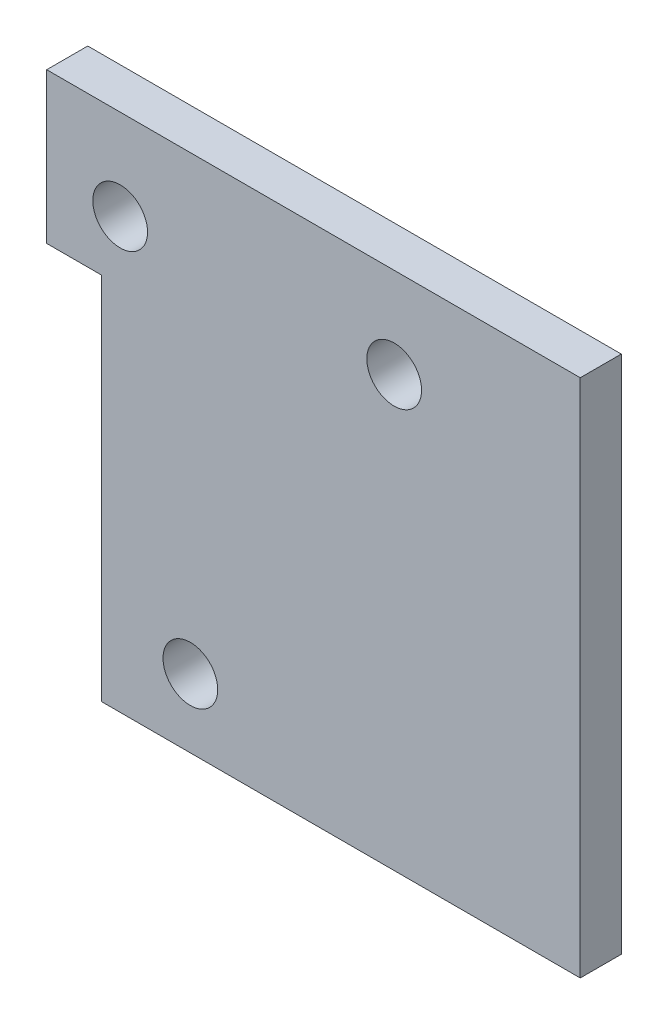
ISO-10303-21;
HEADER;
FILE_DESCRIPTION(('STEP AP214'),'2;1');
FILE_NAME('part.step','',(''),(''),'','','');
FILE_SCHEMA(('AUTOMOTIVE_DESIGN { 1 0 10303 214 1 1 1 1 }'));
ENDSEC;
DATA;
#1=APPLICATION_CONTEXT('core data for automotive mechanical design processes');
#2=APPLICATION_PROTOCOL_DEFINITION('international standard','automotive_design',2000,#1);
#3=PRODUCT_CONTEXT('',#1,'mechanical');
#4=PRODUCT('Part','Part','',(#3));
#5=PRODUCT_RELATED_PRODUCT_CATEGORY('part','',(#4));
#6=PRODUCT_DEFINITION_FORMATION('','',#4);
#7=PRODUCT_DEFINITION_CONTEXT('part definition',#1,'design');
#8=PRODUCT_DEFINITION('design','',#6,#7);
#9=PRODUCT_DEFINITION_SHAPE('','',#8);
#10=(LENGTH_UNIT() NAMED_UNIT(*) SI_UNIT(.MILLI.,.METRE.));
#11=(NAMED_UNIT(*) PLANE_ANGLE_UNIT() SI_UNIT($,.RADIAN.));
#12=(NAMED_UNIT(*) SI_UNIT($,.STERADIAN.) SOLID_ANGLE_UNIT());
#13=UNCERTAINTY_MEASURE_WITH_UNIT(LENGTH_MEASURE(1.E-05),#10,'distance_accuracy_value','');
#14=(GEOMETRIC_REPRESENTATION_CONTEXT(3) GLOBAL_UNCERTAINTY_ASSIGNED_CONTEXT((#13)) GLOBAL_UNIT_ASSIGNED_CONTEXT((#10,
#11,#12)) REPRESENTATION_CONTEXT('',''));
#15=CARTESIAN_POINT('',(0.,0.,0.));
#16=DIRECTION('',(0.,0.,1.));
#17=DIRECTION('',(1.,0.,0.));
#18=AXIS2_PLACEMENT_3D('',#15,#16,#17);
#19=CARTESIAN_POINT('',(39.,0.,3.));
#20=DIRECTION('',(-1.,0.,0.));
#21=DIRECTION('',(0.,0.,1.));
#22=AXIS2_PLACEMENT_3D('',#19,#20,#21);
#23=PLANE('',#22);
#24=DIRECTION('',(0.,1.,0.));
#25=VECTOR('',#24,1.);
#26=CARTESIAN_POINT('',(39.,0.,0.));
#27=LINE('',#26,#25);
#28=CARTESIAN_POINT('',(39.,0.,0.));
#29=VERTEX_POINT('',#28);
#30=CARTESIAN_POINT('',(39.,38.,0.));
#31=VERTEX_POINT('',#30);
#32=EDGE_CURVE('E118',#29,#31,#27,.T.);
#33=ORIENTED_EDGE('',*,*,#32,.T.);
#34=DIRECTION('',(0.,0.,-1.));
#35=VECTOR('',#34,1.);
#36=CARTESIAN_POINT('',(39.,38.,3.));
#37=LINE('',#36,#35);
#38=CARTESIAN_POINT('',(39.,38.,3.));
#39=VERTEX_POINT('',#38);
#40=EDGE_CURVE('E136',#39,#31,#37,.T.);
#41=ORIENTED_EDGE('',*,*,#40,.F.);
#42=DIRECTION('',(0.,1.,0.));
#43=VECTOR('',#42,1.);
#44=CARTESIAN_POINT('',(39.,0.,3.));
#45=LINE('',#44,#43);
#46=CARTESIAN_POINT('',(39.,0.,3.));
#47=VERTEX_POINT('',#46);
#48=EDGE_CURVE('E129',#47,#39,#45,.T.);
#49=ORIENTED_EDGE('',*,*,#48,.F.);
#50=DIRECTION('',(0.,0.,-1.));
#51=VECTOR('',#50,1.);
#52=CARTESIAN_POINT('',(39.,0.,3.));
#53=LINE('',#52,#51);
#54=EDGE_CURVE('E114',#47,#29,#53,.T.);
#55=ORIENTED_EDGE('',*,*,#54,.T.);
#56=EDGE_LOOP('',(#33,#41,#49,#55));
#57=FACE_BOUND('',#56,.T.);
#58=ADVANCED_FACE('F32',(#57),#23,.F.);
#59=CARTESIAN_POINT('',(0.,38.,3.));
#60=DIRECTION('',(0.,-1.,0.));
#61=DIRECTION('',(0.,0.,-1.));
#62=AXIS2_PLACEMENT_3D('',#59,#60,#61);
#63=PLANE('',#62);
#64=DIRECTION('',(-1.,0.,0.));
#65=VECTOR('',#64,1.);
#66=CARTESIAN_POINT('',(0.,38.,0.));
#67=LINE('',#66,#65);
#68=CARTESIAN_POINT('',(0.,38.,0.));
#69=VERTEX_POINT('',#68);
#70=EDGE_CURVE('E121',#31,#69,#67,.T.);
#71=ORIENTED_EDGE('',*,*,#70,.T.);
#72=DIRECTION('',(0.,0.,-1.));
#73=VECTOR('',#72,1.);
#74=CARTESIAN_POINT('',(0.,38.,3.));
#75=LINE('',#74,#73);
#76=CARTESIAN_POINT('',(0.,38.,3.));
#77=VERTEX_POINT('',#76);
#78=EDGE_CURVE('E133',#77,#69,#75,.T.);
#79=ORIENTED_EDGE('',*,*,#78,.F.);
#80=DIRECTION('',(-1.,0.,0.));
#81=VECTOR('',#80,1.);
#82=CARTESIAN_POINT('',(0.,38.,3.));
#83=LINE('',#82,#81);
#84=EDGE_CURVE('E86',#39,#77,#83,.T.);
#85=ORIENTED_EDGE('',*,*,#84,.F.);
#86=ORIENTED_EDGE('',*,*,#40,.T.);
#87=EDGE_LOOP('',(#71,#79,#85,#86));
#88=FACE_BOUND('',#87,.T.);
#89=ADVANCED_FACE('F169',(#88),#63,.F.);
#90=CARTESIAN_POINT('',(0.,27.,3.));
#91=DIRECTION('',(1.,0.,0.));
#92=DIRECTION('',(0.,0.,-1.));
#93=AXIS2_PLACEMENT_3D('',#90,#91,#92);
#94=PLANE('',#93);
#95=DIRECTION('',(0.,-1.,0.));
#96=VECTOR('',#95,1.);
#97=CARTESIAN_POINT('',(0.,27.,0.));
#98=LINE('',#97,#96);
#99=CARTESIAN_POINT('',(0.,27.,0.));
#100=VERTEX_POINT('',#99);
#101=EDGE_CURVE('E124',#69,#100,#98,.T.);
#102=ORIENTED_EDGE('',*,*,#101,.T.);
#103=DIRECTION('',(0.,0.,-1.));
#104=VECTOR('',#103,1.);
#105=CARTESIAN_POINT('',(0.,27.,3.));
#106=LINE('',#105,#104);
#107=CARTESIAN_POINT('',(0.,27.,3.));
#108=VERTEX_POINT('',#107);
#109=EDGE_CURVE('E109',#108,#100,#106,.T.);
#110=ORIENTED_EDGE('',*,*,#109,.F.);
#111=DIRECTION('',(0.,-1.,0.));
#112=VECTOR('',#111,1.);
#113=CARTESIAN_POINT('',(0.,27.,3.));
#114=LINE('',#113,#112);
#115=EDGE_CURVE('E100',#77,#108,#114,.T.);
#116=ORIENTED_EDGE('',*,*,#115,.F.);
#117=ORIENTED_EDGE('',*,*,#78,.T.);
#118=EDGE_LOOP('',(#102,#110,#116,#117));
#119=FACE_BOUND('',#118,.T.);
#120=ADVANCED_FACE('F173',(#119),#94,.F.);
#121=CARTESIAN_POINT('',(0.,27.,3.));
#122=DIRECTION('',(0.,1.,0.));
#123=DIRECTION('',(0.,0.,1.));
#124=AXIS2_PLACEMENT_3D('',#121,#122,#123);
#125=PLANE('',#124);
#126=DIRECTION('',(1.,0.,0.));
#127=VECTOR('',#126,1.);
#128=CARTESIAN_POINT('',(0.,27.,0.));
#129=LINE('',#128,#127);
#130=CARTESIAN_POINT('',(3.99999999999999,27.,0.));
#131=VERTEX_POINT('',#130);
#132=EDGE_CURVE('E108',#100,#131,#129,.T.);
#133=ORIENTED_EDGE('',*,*,#132,.T.);
#134=DIRECTION('',(0.,0.,-1.));
#135=VECTOR('',#134,1.);
#136=CARTESIAN_POINT('',(3.99999999999999,27.,3.));
#137=LINE('',#136,#135);
#138=CARTESIAN_POINT('',(3.99999999999999,27.,3.));
#139=VERTEX_POINT('',#138);
#140=EDGE_CURVE('E105',#139,#131,#137,.T.);
#141=ORIENTED_EDGE('',*,*,#140,.F.);
#142=DIRECTION('',(1.,0.,0.));
#143=VECTOR('',#142,1.);
#144=CARTESIAN_POINT('',(0.,27.,3.));
#145=LINE('',#144,#143);
#146=EDGE_CURVE('E93',#108,#139,#145,.T.);
#147=ORIENTED_EDGE('',*,*,#146,.F.);
#148=ORIENTED_EDGE('',*,*,#109,.T.);
#149=EDGE_LOOP('',(#133,#141,#147,#148));
#150=FACE_BOUND('',#149,.T.);
#151=ADVANCED_FACE('F106',(#150),#125,.F.);
#152=CARTESIAN_POINT('',(4.,0.,3.));
#153=DIRECTION('',(1.,0.,0.));
#154=DIRECTION('',(0.,1.,0.));
#155=AXIS2_PLACEMENT_3D('',#152,#153,#154);
#156=PLANE('',#155);
#157=DIRECTION('',(0.,-1.,0.));
#158=VECTOR('',#157,1.);
#159=CARTESIAN_POINT('',(4.,0.,0.));
#160=LINE('',#159,#158);
#161=CARTESIAN_POINT('',(4.,0.,0.));
#162=VERTEX_POINT('',#161);
#163=EDGE_CURVE('E71',#131,#162,#160,.T.);
#164=ORIENTED_EDGE('',*,*,#163,.T.);
#165=DIRECTION('',(0.,0.,-1.));
#166=VECTOR('',#165,1.);
#167=CARTESIAN_POINT('',(4.,0.,3.));
#168=LINE('',#167,#166);
#169=CARTESIAN_POINT('',(4.,0.,3.));
#170=VERTEX_POINT('',#169);
#171=EDGE_CURVE('E110',#170,#162,#168,.T.);
#172=ORIENTED_EDGE('',*,*,#171,.F.);
#173=DIRECTION('',(0.,-1.,0.));
#174=VECTOR('',#173,1.);
#175=CARTESIAN_POINT('',(4.,0.,3.));
#176=LINE('',#175,#174);
#177=EDGE_CURVE('E98',#139,#170,#176,.T.);
#178=ORIENTED_EDGE('',*,*,#177,.F.);
#179=ORIENTED_EDGE('',*,*,#140,.T.);
#180=EDGE_LOOP('',(#164,#172,#178,#179));
#181=FACE_BOUND('',#180,.T.);
#182=ADVANCED_FACE('F112',(#181),#156,.F.);
#183=CARTESIAN_POINT('',(4.,0.,3.));
#184=DIRECTION('',(0.,1.,0.));
#185=DIRECTION('',(0.,0.,1.));
#186=AXIS2_PLACEMENT_3D('',#183,#184,#185);
#187=PLANE('',#186);
#188=DIRECTION('',(1.,0.,0.));
#189=VECTOR('',#188,1.);
#190=CARTESIAN_POINT('',(4.,0.,0.));
#191=LINE('',#190,#189);
#192=EDGE_CURVE('E77',#162,#29,#191,.T.);
#193=ORIENTED_EDGE('',*,*,#192,.T.);
#194=ORIENTED_EDGE('',*,*,#54,.F.);
#195=DIRECTION('',(1.,0.,0.));
#196=VECTOR('',#195,1.);
#197=CARTESIAN_POINT('',(4.,0.,3.));
#198=LINE('',#197,#196);
#199=EDGE_CURVE('E48',#170,#47,#198,.T.);
#200=ORIENTED_EDGE('',*,*,#199,.F.);
#201=ORIENTED_EDGE('',*,*,#171,.T.);
#202=EDGE_LOOP('',(#193,#194,#200,#201));
#203=FACE_BOUND('',#202,.T.);
#204=ADVANCED_FACE('F159',(#203),#187,.F.);
#205=CARTESIAN_POINT('',(0.,0.,3.));
#206=DIRECTION('',(0.,0.,-1.));
#207=DIRECTION('',(-1.,0.,0.));
#208=AXIS2_PLACEMENT_3D('',#205,#206,#207);
#209=PLANE('',#208);
#210=ORIENTED_EDGE('',*,*,#48,.T.);
#211=ORIENTED_EDGE('',*,*,#84,.T.);
#212=ORIENTED_EDGE('',*,*,#115,.T.);
#213=ORIENTED_EDGE('',*,*,#146,.T.);
#214=ORIENTED_EDGE('',*,*,#177,.T.);
#215=ORIENTED_EDGE('',*,*,#199,.T.);
#216=EDGE_LOOP('',(#210,#211,#212,#213,#214,#215));
#217=FACE_BOUND('',#216,.T.);
#218=CARTESIAN_POINT('',(5.37,31.4,3.));
#219=DIRECTION('',(0.,0.,1.));
#220=DIRECTION('',(1.,0.,0.));
#221=AXIS2_PLACEMENT_3D('',#218,#219,#220);
#222=CIRCLE('',#221,2.);
#223=CARTESIAN_POINT('',(7.37,31.4,3.));
#224=VERTEX_POINT('',#223);
#225=EDGE_CURVE('E122',#224,#224,#222,.T.);
#226=ORIENTED_EDGE('',*,*,#225,.F.);
#227=EDGE_LOOP('',(#226));
#228=FACE_BOUND('',#227,.T.);
#229=CARTESIAN_POINT('',(25.4,31.4,3.));
#230=DIRECTION('',(0.,0.,1.));
#231=DIRECTION('',(1.,0.,0.));
#232=AXIS2_PLACEMENT_3D('',#229,#230,#231);
#233=CIRCLE('',#232,2.00000000000001);
#234=CARTESIAN_POINT('',(27.4,31.4,3.));
#235=VERTEX_POINT('',#234);
#236=EDGE_CURVE('E325',#235,#235,#233,.T.);
#237=ORIENTED_EDGE('',*,*,#236,.F.);
#238=EDGE_LOOP('',(#237));
#239=FACE_BOUND('',#238,.T.);
#240=CARTESIAN_POINT('',(10.5,5.,3.));
#241=DIRECTION('',(0.,0.,1.));
#242=DIRECTION('',(1.,0.,0.));
#243=AXIS2_PLACEMENT_3D('',#240,#241,#242);
#244=CIRCLE('',#243,2.);
#245=CARTESIAN_POINT('',(12.5,5.,3.));
#246=VERTEX_POINT('',#245);
#247=EDGE_CURVE('E322',#246,#246,#244,.T.);
#248=ORIENTED_EDGE('',*,*,#247,.F.);
#249=EDGE_LOOP('',(#248));
#250=FACE_BOUND('',#249,.T.);
#251=ADVANCED_FACE('F95',(#217,#228,#239,#250),#209,.F.);
#252=CARTESIAN_POINT('',(0.,0.,0.));
#253=DIRECTION('',(0.,0.,-1.));
#254=DIRECTION('',(-1.,0.,0.));
#255=AXIS2_PLACEMENT_3D('',#252,#253,#254);
#256=PLANE('',#255);
#257=CARTESIAN_POINT('',(10.5,5.,0.));
#258=DIRECTION('',(0.,0.,-1.));
#259=DIRECTION('',(-1.,0.,0.));
#260=AXIS2_PLACEMENT_3D('',#257,#258,#259);
#261=CIRCLE('',#260,2.5);
#262=CARTESIAN_POINT('',(7.99999999999999,5.,0.));
#263=VERTEX_POINT('',#262);
#264=EDGE_CURVE('E11',#263,#263,#261,.T.);
#265=ORIENTED_EDGE('',*,*,#264,.F.);
#266=EDGE_LOOP('',(#265));
#267=FACE_BOUND('',#266,.T.);
#268=CARTESIAN_POINT('',(25.4,31.4,0.));
#269=DIRECTION('',(0.,0.,-1.));
#270=DIRECTION('',(-1.,0.,0.));
#271=AXIS2_PLACEMENT_3D('',#268,#269,#270);
#272=CIRCLE('',#271,2.5);
#273=CARTESIAN_POINT('',(22.9,31.4,0.));
#274=VERTEX_POINT('',#273);
#275=EDGE_CURVE('E40',#274,#274,#272,.T.);
#276=ORIENTED_EDGE('',*,*,#275,.F.);
#277=EDGE_LOOP('',(#276));
#278=FACE_BOUND('',#277,.T.);
#279=CARTESIAN_POINT('',(5.37,31.4,0.));
#280=DIRECTION('',(0.,0.,-1.));
#281=DIRECTION('',(-1.,0.,0.));
#282=AXIS2_PLACEMENT_3D('',#279,#280,#281);
#283=CIRCLE('',#282,2.5);
#284=CARTESIAN_POINT('',(2.87,31.4,0.));
#285=VERTEX_POINT('',#284);
#286=EDGE_CURVE('E138',#285,#285,#283,.T.);
#287=ORIENTED_EDGE('',*,*,#286,.F.);
#288=EDGE_LOOP('',(#287));
#289=FACE_BOUND('',#288,.T.);
#290=ORIENTED_EDGE('',*,*,#32,.F.);
#291=ORIENTED_EDGE('',*,*,#192,.F.);
#292=ORIENTED_EDGE('',*,*,#163,.F.);
#293=ORIENTED_EDGE('',*,*,#132,.F.);
#294=ORIENTED_EDGE('',*,*,#101,.F.);
#295=ORIENTED_EDGE('',*,*,#70,.F.);
#296=EDGE_LOOP('',(#290,#291,#292,#293,#294,#295));
#297=FACE_BOUND('',#296,.T.);
#298=ADVANCED_FACE('F146',(#267,#278,#289,#297),#256,.T.);
#299=CARTESIAN_POINT('',(10.5,5.,0.));
#300=DIRECTION('',(0.,0.,1.));
#301=DIRECTION('',(1.,0.,0.));
#302=AXIS2_PLACEMENT_3D('',#299,#300,#301);
#303=CYLINDRICAL_SURFACE('',#302,2.);
#304=ORIENTED_EDGE('',*,*,#247,.T.);
#305=EDGE_LOOP('',(#304));
#306=FACE_BOUND('',#305,.T.);
#307=CARTESIAN_POINT('',(10.5,5.,-3.));
#308=DIRECTION('',(0.,0.,1.));
#309=DIRECTION('',(1.,0.,0.));
#310=AXIS2_PLACEMENT_3D('',#307,#308,#309);
#311=CIRCLE('',#310,2.);
#312=CARTESIAN_POINT('',(12.5,5.,-3.));
#313=VERTEX_POINT('',#312);
#314=EDGE_CURVE('E302',#313,#313,#311,.T.);
#315=ORIENTED_EDGE('',*,*,#314,.F.);
#316=EDGE_LOOP('',(#315));
#317=FACE_BOUND('',#316,.T.);
#318=ADVANCED_FACE('F149',(#306,#317),#303,.F.);
#319=CARTESIAN_POINT('',(25.4,31.4,0.));
#320=DIRECTION('',(0.,0.,1.));
#321=DIRECTION('',(1.,0.,0.));
#322=AXIS2_PLACEMENT_3D('',#319,#320,#321);
#323=CYLINDRICAL_SURFACE('',#322,2.00000000000001);
#324=ORIENTED_EDGE('',*,*,#236,.T.);
#325=EDGE_LOOP('',(#324));
#326=FACE_BOUND('',#325,.T.);
#327=CARTESIAN_POINT('',(25.4,31.4,-3.));
#328=DIRECTION('',(0.,0.,1.));
#329=DIRECTION('',(1.,0.,0.));
#330=AXIS2_PLACEMENT_3D('',#327,#328,#329);
#331=CIRCLE('',#330,2.00000000000001);
#332=CARTESIAN_POINT('',(27.4,31.4,-3.));
#333=VERTEX_POINT('',#332);
#334=EDGE_CURVE('E307',#333,#333,#331,.T.);
#335=ORIENTED_EDGE('',*,*,#334,.F.);
#336=EDGE_LOOP('',(#335));
#337=FACE_BOUND('',#336,.T.);
#338=ADVANCED_FACE('F215',(#326,#337),#323,.F.);
#339=CARTESIAN_POINT('',(5.37,31.4,0.));
#340=DIRECTION('',(0.,0.,1.));
#341=DIRECTION('',(1.,0.,0.));
#342=AXIS2_PLACEMENT_3D('',#339,#340,#341);
#343=CYLINDRICAL_SURFACE('',#342,2.);
#344=ORIENTED_EDGE('',*,*,#225,.T.);
#345=EDGE_LOOP('',(#344));
#346=FACE_BOUND('',#345,.T.);
#347=CARTESIAN_POINT('',(5.37,31.4,-3.));
#348=DIRECTION('',(0.,0.,1.));
#349=DIRECTION('',(1.,0.,0.));
#350=AXIS2_PLACEMENT_3D('',#347,#348,#349);
#351=CIRCLE('',#350,2.);
#352=CARTESIAN_POINT('',(7.37,31.4,-3.));
#353=VERTEX_POINT('',#352);
#354=EDGE_CURVE('E316',#353,#353,#351,.T.);
#355=ORIENTED_EDGE('',*,*,#354,.F.);
#356=EDGE_LOOP('',(#355));
#357=FACE_BOUND('',#356,.T.);
#358=ADVANCED_FACE('F226',(#346,#357),#343,.F.);
#359=CARTESIAN_POINT('',(5.37,31.4,-3.));
#360=DIRECTION('',(0.,0.,1.));
#361=DIRECTION('',(1.,0.,0.));
#362=AXIS2_PLACEMENT_3D('',#359,#360,#361);
#363=CYLINDRICAL_SURFACE('',#362,2.5);
#364=ORIENTED_EDGE('',*,*,#286,.T.);
#365=EDGE_LOOP('',(#364));
#366=FACE_BOUND('',#365,.T.);
#367=CARTESIAN_POINT('',(5.37,31.4,-3.));
#368=DIRECTION('',(0.,0.,1.));
#369=DIRECTION('',(1.,0.,0.));
#370=AXIS2_PLACEMENT_3D('',#367,#368,#369);
#371=CIRCLE('',#370,2.5);
#372=CARTESIAN_POINT('',(7.87,31.4,-3.));
#373=VERTEX_POINT('',#372);
#374=EDGE_CURVE('E319',#373,#373,#371,.T.);
#375=ORIENTED_EDGE('',*,*,#374,.T.);
#376=EDGE_LOOP('',(#375));
#377=FACE_BOUND('',#376,.T.);
#378=ADVANCED_FACE('F237',(#366,#377),#363,.T.);
#379=CARTESIAN_POINT('',(5.37,31.4,-3.));
#380=DIRECTION('',(0.,0.,1.));
#381=DIRECTION('',(1.,0.,0.));
#382=AXIS2_PLACEMENT_3D('',#379,#380,#381);
#383=PLANE('',#382);
#384=ORIENTED_EDGE('',*,*,#354,.T.);
#385=EDGE_LOOP('',(#384));
#386=FACE_BOUND('',#385,.T.);
#387=ORIENTED_EDGE('',*,*,#374,.F.);
#388=EDGE_LOOP('',(#387));
#389=FACE_BOUND('',#388,.T.);
#390=ADVANCED_FACE('F247',(#386,#389),#383,.F.);
#391=CARTESIAN_POINT('',(25.4,31.4,-3.));
#392=DIRECTION('',(0.,0.,1.));
#393=DIRECTION('',(1.,0.,0.));
#394=AXIS2_PLACEMENT_3D('',#391,#392,#393);
#395=CYLINDRICAL_SURFACE('',#394,2.5);
#396=ORIENTED_EDGE('',*,*,#275,.T.);
#397=EDGE_LOOP('',(#396));
#398=FACE_BOUND('',#397,.T.);
#399=CARTESIAN_POINT('',(25.4,31.4,-3.));
#400=DIRECTION('',(0.,0.,1.));
#401=DIRECTION('',(1.,0.,0.));
#402=AXIS2_PLACEMENT_3D('',#399,#400,#401);
#403=CIRCLE('',#402,2.5);
#404=CARTESIAN_POINT('',(27.9,31.4,-3.));
#405=VERTEX_POINT('',#404);
#406=EDGE_CURVE('E310',#405,#405,#403,.T.);
#407=ORIENTED_EDGE('',*,*,#406,.T.);
#408=EDGE_LOOP('',(#407));
#409=FACE_BOUND('',#408,.T.);
#410=ADVANCED_FACE('F143',(#398,#409),#395,.T.);
#411=CARTESIAN_POINT('',(25.4,31.4,-3.));
#412=DIRECTION('',(0.,0.,1.));
#413=DIRECTION('',(1.,0.,0.));
#414=AXIS2_PLACEMENT_3D('',#411,#412,#413);
#415=PLANE('',#414);
#416=ORIENTED_EDGE('',*,*,#334,.T.);
#417=EDGE_LOOP('',(#416));
#418=FACE_BOUND('',#417,.T.);
#419=ORIENTED_EDGE('',*,*,#406,.F.);
#420=EDGE_LOOP('',(#419));
#421=FACE_BOUND('',#420,.T.);
#422=ADVANCED_FACE('F266',(#418,#421),#415,.F.);
#423=CARTESIAN_POINT('',(10.5,5.,-3.));
#424=DIRECTION('',(0.,0.,1.));
#425=DIRECTION('',(1.,0.,0.));
#426=AXIS2_PLACEMENT_3D('',#423,#424,#425);
#427=CYLINDRICAL_SURFACE('',#426,2.5);
#428=ORIENTED_EDGE('',*,*,#264,.T.);
#429=EDGE_LOOP('',(#428));
#430=FACE_BOUND('',#429,.T.);
#431=CARTESIAN_POINT('',(10.5,5.,-3.));
#432=DIRECTION('',(0.,0.,1.));
#433=DIRECTION('',(1.,0.,0.));
#434=AXIS2_PLACEMENT_3D('',#431,#432,#433);
#435=CIRCLE('',#434,2.5);
#436=CARTESIAN_POINT('',(13.,5.,-3.));
#437=VERTEX_POINT('',#436);
#438=EDGE_CURVE('E305',#437,#437,#435,.T.);
#439=ORIENTED_EDGE('',*,*,#438,.T.);
#440=EDGE_LOOP('',(#439));
#441=FACE_BOUND('',#440,.T.);
#442=ADVANCED_FACE('F275',(#430,#441),#427,.T.);
#443=CARTESIAN_POINT('',(10.5,5.,-3.));
#444=DIRECTION('',(0.,0.,1.));
#445=DIRECTION('',(1.,0.,0.));
#446=AXIS2_PLACEMENT_3D('',#443,#444,#445);
#447=PLANE('',#446);
#448=ORIENTED_EDGE('',*,*,#314,.T.);
#449=EDGE_LOOP('',(#448));
#450=FACE_BOUND('',#449,.T.);
#451=ORIENTED_EDGE('',*,*,#438,.F.);
#452=EDGE_LOOP('',(#451));
#453=FACE_BOUND('',#452,.T.);
#454=ADVANCED_FACE('F285',(#450,#453),#447,.F.);
#455=CLOSED_SHELL('',(#58,#89,#120,#151,#182,#204,#251,#298,#318,#338,#358,#378,#390,#410,#422,
#442,#454));
#456=MANIFOLD_SOLID_BREP('B2',#455);
#457=ADVANCED_BREP_SHAPE_REPRESENTATION('',(#18,#456),#14);
#458=SHAPE_DEFINITION_REPRESENTATION(#9,#457);
ENDSEC;
END-ISO-10303-21;
